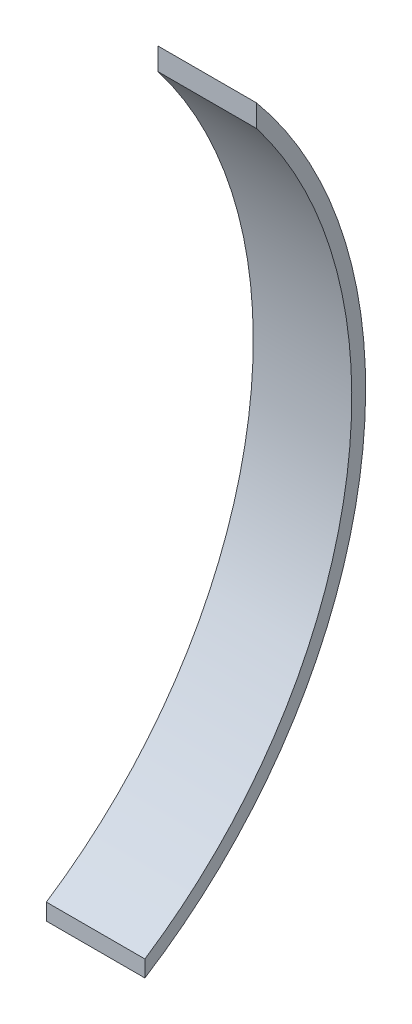
ISO-10303-21;
HEADER;
FILE_DESCRIPTION(('STEP AP214'),'2;1');
FILE_NAME('part.step','',(''),(''),'','','');
FILE_SCHEMA(('AUTOMOTIVE_DESIGN { 1 0 10303 214 1 1 1 1 }'));
ENDSEC;
DATA;
#1=APPLICATION_CONTEXT('core data for automotive mechanical design processes');
#2=APPLICATION_PROTOCOL_DEFINITION('international standard','automotive_design',2000,#1);
#3=PRODUCT_CONTEXT('',#1,'mechanical');
#4=PRODUCT('Part','Part','',(#3));
#5=PRODUCT_RELATED_PRODUCT_CATEGORY('part','',(#4));
#6=PRODUCT_DEFINITION_FORMATION('','',#4);
#7=PRODUCT_DEFINITION_CONTEXT('part definition',#1,'design');
#8=PRODUCT_DEFINITION('design','',#6,#7);
#9=PRODUCT_DEFINITION_SHAPE('','',#8);
#10=(LENGTH_UNIT() NAMED_UNIT(*) SI_UNIT(.MILLI.,.METRE.));
#11=(NAMED_UNIT(*) PLANE_ANGLE_UNIT() SI_UNIT($,.RADIAN.));
#12=(NAMED_UNIT(*) SI_UNIT($,.STERADIAN.) SOLID_ANGLE_UNIT());
#13=UNCERTAINTY_MEASURE_WITH_UNIT(LENGTH_MEASURE(1.E-05),#10,'distance_accuracy_value','');
#14=(GEOMETRIC_REPRESENTATION_CONTEXT(3) GLOBAL_UNCERTAINTY_ASSIGNED_CONTEXT((#13)) GLOBAL_UNIT_ASSIGNED_CONTEXT((#10,
#11,#12)) REPRESENTATION_CONTEXT('',''));
#15=CARTESIAN_POINT('',(0.,0.,0.));
#16=DIRECTION('',(0.,0.,1.));
#17=DIRECTION('',(1.,0.,0.));
#18=AXIS2_PLACEMENT_3D('',#15,#16,#17);
#19=CARTESIAN_POINT('',(30.,-30.789886547677,76.726917698007));
#20=DIRECTION('',(-1.,0.,0.));
#21=DIRECTION('',(0.,0.,1.));
#22=AXIS2_PLACEMENT_3D('',#19,#20,#21);
#23=CYLINDRICAL_SURFACE('',#22,139.726917698007);
#24=CARTESIAN_POINT('',(0.,-30.789886547677,76.726917698007));
#25=DIRECTION('',(-1.,0.,0.));
#26=DIRECTION('',(0.,0.,1.));
#27=AXIS2_PLACEMENT_3D('',#24,#25,#26);
#28=CIRCLE('',#27,139.726917698007);
#29=CARTESIAN_POINT('',(0.,54.4342956219654,-34.));
#30=VERTEX_POINT('',#29);
#31=CARTESIAN_POINT('',(0.,-147.565704378035,0.));
#32=VERTEX_POINT('',#31);
#33=EDGE_CURVE('E97',#30,#32,#28,.T.);
#34=ORIENTED_EDGE('',*,*,#33,.T.);
#35=DIRECTION('',(-1.,0.,0.));
#36=VECTOR('',#35,1.);
#37=CARTESIAN_POINT('',(30.,-147.565704378035,0.));
#38=LINE('',#37,#36);
#39=CARTESIAN_POINT('',(30.,-147.565704378035,0.));
#40=VERTEX_POINT('',#39);
#41=EDGE_CURVE('E11',#40,#32,#38,.T.);
#42=ORIENTED_EDGE('',*,*,#41,.F.);
#43=CARTESIAN_POINT('',(30.,-30.789886547677,76.726917698007));
#44=DIRECTION('',(-1.,0.,0.));
#45=DIRECTION('',(0.,0.,1.));
#46=AXIS2_PLACEMENT_3D('',#43,#44,#45);
#47=CIRCLE('',#46,139.726917698007);
#48=CARTESIAN_POINT('',(30.,54.4342956219654,-34.));
#49=VERTEX_POINT('',#48);
#50=EDGE_CURVE('E85',#49,#40,#47,.T.);
#51=ORIENTED_EDGE('',*,*,#50,.F.);
#52=DIRECTION('',(-1.,0.,0.));
#53=VECTOR('',#52,1.);
#54=CARTESIAN_POINT('',(30.,54.4342956219654,-34.));
#55=LINE('',#54,#53);
#56=EDGE_CURVE('E93',#49,#30,#55,.T.);
#57=ORIENTED_EDGE('',*,*,#56,.T.);
#58=EDGE_LOOP('',(#34,#42,#51,#57));
#59=FACE_BOUND('',#58,.T.);
#60=ADVANCED_FACE('F34',(#59),#23,.F.);
#61=CARTESIAN_POINT('',(30.,-147.565704378035,0.));
#62=DIRECTION('',(0.,0.,-1.));
#63=DIRECTION('',(0.,1.,0.));
#64=AXIS2_PLACEMENT_3D('',#61,#62,#63);
#65=PLANE('',#64);
#66=DIRECTION('',(0.,-1.,0.));
#67=VECTOR('',#66,1.);
#68=CARTESIAN_POINT('',(0.,-147.565704378035,0.));
#69=LINE('',#68,#67);
#70=CARTESIAN_POINT('',(0.,-152.588372424716,0.));
#71=VERTEX_POINT('',#70);
#72=EDGE_CURVE('E89',#32,#71,#69,.T.);
#73=ORIENTED_EDGE('',*,*,#72,.T.);
#74=DIRECTION('',(-1.,0.,0.));
#75=VECTOR('',#74,1.);
#76=CARTESIAN_POINT('',(30.,-152.588372424716,0.));
#77=LINE('',#76,#75);
#78=CARTESIAN_POINT('',(30.,-152.588372424716,0.));
#79=VERTEX_POINT('',#78);
#80=EDGE_CURVE('E42',#79,#71,#77,.T.);
#81=ORIENTED_EDGE('',*,*,#80,.F.);
#82=DIRECTION('',(0.,-1.,0.));
#83=VECTOR('',#82,1.);
#84=CARTESIAN_POINT('',(30.,-147.565704378035,0.));
#85=LINE('',#84,#83);
#86=EDGE_CURVE('E80',#40,#79,#85,.T.);
#87=ORIENTED_EDGE('',*,*,#86,.F.);
#88=ORIENTED_EDGE('',*,*,#41,.T.);
#89=EDGE_LOOP('',(#73,#81,#87,#88));
#90=FACE_BOUND('',#89,.T.);
#91=ADVANCED_FACE('F88',(#90),#65,.F.);
#92=CARTESIAN_POINT('',(30.,-30.789886547677,76.726917698007));
#93=DIRECTION('',(-1.,0.,0.));
#94=DIRECTION('',(0.,0.,1.));
#95=AXIS2_PLACEMENT_3D('',#92,#93,#94);
#96=CYLINDRICAL_SURFACE('',#95,143.951002293753);
#97=CARTESIAN_POINT('',(0.,-30.789886547677,76.726917698007));
#98=DIRECTION('',(1.,0.,0.));
#99=DIRECTION('',(0.,0.,1.));
#100=AXIS2_PLACEMENT_3D('',#97,#98,#99);
#101=CIRCLE('',#100,143.951002293753);
#102=CARTESIAN_POINT('',(0.,61.196203479429,-34.));
#103=VERTEX_POINT('',#102);
#104=EDGE_CURVE('E67',#71,#103,#101,.T.);
#105=ORIENTED_EDGE('',*,*,#104,.T.);
#106=DIRECTION('',(-1.,0.,0.));
#107=VECTOR('',#106,1.);
#108=CARTESIAN_POINT('',(30.,61.196203479429,-34.));
#109=LINE('',#108,#107);
#110=CARTESIAN_POINT('',(30.,61.196203479429,-34.));
#111=VERTEX_POINT('',#110);
#112=EDGE_CURVE('E90',#111,#103,#109,.T.);
#113=ORIENTED_EDGE('',*,*,#112,.F.);
#114=CARTESIAN_POINT('',(30.,-30.789886547677,76.726917698007));
#115=DIRECTION('',(1.,0.,0.));
#116=DIRECTION('',(0.,0.,1.));
#117=AXIS2_PLACEMENT_3D('',#114,#115,#116);
#118=CIRCLE('',#117,143.951002293753);
#119=EDGE_CURVE('E83',#79,#111,#118,.T.);
#120=ORIENTED_EDGE('',*,*,#119,.F.);
#121=ORIENTED_EDGE('',*,*,#80,.T.);
#122=EDGE_LOOP('',(#105,#113,#120,#121));
#123=FACE_BOUND('',#122,.T.);
#124=ADVANCED_FACE('F91',(#123),#96,.T.);
#125=CARTESIAN_POINT('',(30.,61.196203479429,-34.));
#126=DIRECTION('',(0.,0.,-1.));
#127=DIRECTION('',(-1.,0.,0.));
#128=AXIS2_PLACEMENT_3D('',#125,#126,#127);
#129=PLANE('',#128);
#130=DIRECTION('',(0.,-1.,0.));
#131=VECTOR('',#130,1.);
#132=CARTESIAN_POINT('',(0.,61.196203479429,-34.));
#133=LINE('',#132,#131);
#134=EDGE_CURVE('E73',#103,#30,#133,.T.);
#135=ORIENTED_EDGE('',*,*,#134,.T.);
#136=ORIENTED_EDGE('',*,*,#56,.F.);
#137=DIRECTION('',(0.,-1.,0.));
#138=VECTOR('',#137,1.);
#139=CARTESIAN_POINT('',(30.,61.196203479429,-34.));
#140=LINE('',#139,#138);
#141=EDGE_CURVE('E50',#111,#49,#140,.T.);
#142=ORIENTED_EDGE('',*,*,#141,.F.);
#143=ORIENTED_EDGE('',*,*,#112,.T.);
#144=EDGE_LOOP('',(#135,#136,#142,#143));
#145=FACE_BOUND('',#144,.T.);
#146=ADVANCED_FACE('F104',(#145),#129,.F.);
#147=CARTESIAN_POINT('',(30.,-30.789886547677,76.726917698007));
#148=DIRECTION('',(-1.,0.,0.));
#149=DIRECTION('',(0.,0.,1.));
#150=AXIS2_PLACEMENT_3D('',#147,#148,#149);
#151=PLANE('',#150);
#152=ORIENTED_EDGE('',*,*,#50,.T.);
#153=ORIENTED_EDGE('',*,*,#86,.T.);
#154=ORIENTED_EDGE('',*,*,#119,.T.);
#155=ORIENTED_EDGE('',*,*,#141,.T.);
#156=EDGE_LOOP('',(#152,#153,#154,#155));
#157=FACE_BOUND('',#156,.T.);
#158=ADVANCED_FACE('F81',(#157),#151,.F.);
#159=CARTESIAN_POINT('',(0.,-30.789886547677,76.726917698007));
#160=DIRECTION('',(-1.,0.,0.));
#161=DIRECTION('',(0.,0.,1.));
#162=AXIS2_PLACEMENT_3D('',#159,#160,#161);
#163=PLANE('',#162);
#164=ORIENTED_EDGE('',*,*,#33,.F.);
#165=ORIENTED_EDGE('',*,*,#134,.F.);
#166=ORIENTED_EDGE('',*,*,#104,.F.);
#167=ORIENTED_EDGE('',*,*,#72,.F.);
#168=EDGE_LOOP('',(#164,#165,#166,#167));
#169=FACE_BOUND('',#168,.T.);
#170=ADVANCED_FACE('F107',(#169),#163,.T.);
#171=CLOSED_SHELL('',(#60,#91,#124,#146,#158,#170));
#172=MANIFOLD_SOLID_BREP('B2',#171);
#173=ADVANCED_BREP_SHAPE_REPRESENTATION('',(#18,#172),#14);
#174=SHAPE_DEFINITION_REPRESENTATION(#9,#173);
ENDSEC;
END-ISO-10303-21;
